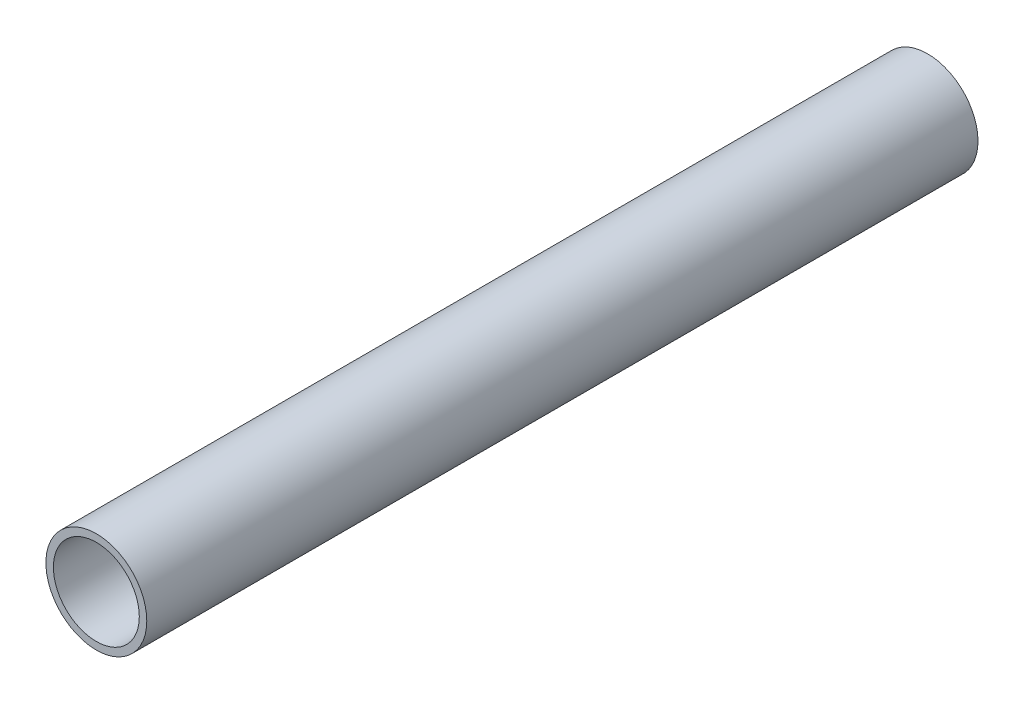
ISO-10303-21;
HEADER;
FILE_DESCRIPTION(('STEP AP214'),'2;1');
FILE_NAME('part.step','',(''),(''),'','','');
FILE_SCHEMA(('AUTOMOTIVE_DESIGN { 1 0 10303 214 1 1 1 1 }'));
ENDSEC;
DATA;
#1=APPLICATION_CONTEXT('core data for automotive mechanical design processes');
#2=APPLICATION_PROTOCOL_DEFINITION('international standard','automotive_design',2000,#1);
#3=PRODUCT_CONTEXT('',#1,'mechanical');
#4=PRODUCT('Part','Part','',(#3));
#5=PRODUCT_RELATED_PRODUCT_CATEGORY('part','',(#4));
#6=PRODUCT_DEFINITION_FORMATION('','',#4);
#7=PRODUCT_DEFINITION_CONTEXT('part definition',#1,'design');
#8=PRODUCT_DEFINITION('design','',#6,#7);
#9=PRODUCT_DEFINITION_SHAPE('','',#8);
#10=(LENGTH_UNIT() NAMED_UNIT(*) SI_UNIT(.MILLI.,.METRE.));
#11=(NAMED_UNIT(*) PLANE_ANGLE_UNIT() SI_UNIT($,.RADIAN.));
#12=(NAMED_UNIT(*) SI_UNIT($,.STERADIAN.) SOLID_ANGLE_UNIT());
#13=UNCERTAINTY_MEASURE_WITH_UNIT(LENGTH_MEASURE(1.E-05),#10,'distance_accuracy_value','');
#14=(GEOMETRIC_REPRESENTATION_CONTEXT(3) GLOBAL_UNCERTAINTY_ASSIGNED_CONTEXT((#13)) GLOBAL_UNIT_ASSIGNED_CONTEXT((#10,
#11,#12)) REPRESENTATION_CONTEXT('',''));
#15=CARTESIAN_POINT('',(0.,0.,0.));
#16=DIRECTION('',(0.,0.,1.));
#17=DIRECTION('',(1.,0.,0.));
#18=AXIS2_PLACEMENT_3D('',#15,#16,#17);
#19=CARTESIAN_POINT('',(0.,0.,44.5));
#20=DIRECTION('',(0.,0.,1.));
#21=DIRECTION('',(1.,0.,0.));
#22=AXIS2_PLACEMENT_3D('',#19,#20,#21);
#23=PLANE('',#22);
#24=CARTESIAN_POINT('',(0.,0.,44.5));
#25=DIRECTION('',(0.,0.,1.));
#26=DIRECTION('',(1.,0.,0.));
#27=AXIS2_PLACEMENT_3D('',#24,#25,#26);
#28=CIRCLE('',#27,2.7);
#29=CARTESIAN_POINT('',(2.7,0.,44.5));
#30=VERTEX_POINT('',#29);
#31=EDGE_CURVE('E10',#30,#30,#28,.T.);
#32=ORIENTED_EDGE('',*,*,#31,.T.);
#33=EDGE_LOOP('',(#32));
#34=FACE_BOUND('',#33,.T.);
#35=CARTESIAN_POINT('',(0.,0.,44.5));
#36=DIRECTION('',(0.,0.,1.));
#37=DIRECTION('',(1.,0.,0.));
#38=AXIS2_PLACEMENT_3D('',#35,#36,#37);
#39=CIRCLE('',#38,2.3);
#40=CARTESIAN_POINT('',(2.3,0.,44.5));
#41=VERTEX_POINT('',#40);
#42=EDGE_CURVE('E50',#41,#41,#39,.T.);
#43=ORIENTED_EDGE('',*,*,#42,.F.);
#44=EDGE_LOOP('',(#43));
#45=FACE_BOUND('',#44,.T.);
#46=ADVANCED_FACE('F37',(#34,#45),#23,.T.);
#47=CARTESIAN_POINT('',(0.,0.,0.));
#48=DIRECTION('',(0.,0.,1.));
#49=DIRECTION('',(1.,0.,0.));
#50=AXIS2_PLACEMENT_3D('',#47,#48,#49);
#51=PLANE('',#50);
#52=CARTESIAN_POINT('',(0.,0.,0.));
#53=DIRECTION('',(0.,0.,1.));
#54=DIRECTION('',(1.,0.,0.));
#55=AXIS2_PLACEMENT_3D('',#52,#53,#54);
#56=CIRCLE('',#55,2.7);
#57=CARTESIAN_POINT('',(2.7,0.,0.));
#58=VERTEX_POINT('',#57);
#59=EDGE_CURVE('E41',#58,#58,#56,.T.);
#60=ORIENTED_EDGE('',*,*,#59,.F.);
#61=EDGE_LOOP('',(#60));
#62=FACE_BOUND('',#61,.T.);
#63=CARTESIAN_POINT('',(0.,0.,0.));
#64=DIRECTION('',(0.,0.,1.));
#65=DIRECTION('',(1.,0.,0.));
#66=AXIS2_PLACEMENT_3D('',#63,#64,#65);
#67=CIRCLE('',#66,2.3);
#68=CARTESIAN_POINT('',(2.3,0.,0.));
#69=VERTEX_POINT('',#68);
#70=EDGE_CURVE('E52',#69,#69,#67,.T.);
#71=ORIENTED_EDGE('',*,*,#70,.T.);
#72=EDGE_LOOP('',(#71));
#73=FACE_BOUND('',#72,.T.);
#74=ADVANCED_FACE('F64',(#62,#73),#51,.F.);
#75=CARTESIAN_POINT('',(0.,0.,44.5));
#76=DIRECTION('',(0.,0.,-1.));
#77=DIRECTION('',(-1.,0.,0.));
#78=AXIS2_PLACEMENT_3D('',#75,#76,#77);
#79=CYLINDRICAL_SURFACE('',#78,2.7);
#80=ORIENTED_EDGE('',*,*,#31,.F.);
#81=EDGE_LOOP('',(#80));
#82=FACE_BOUND('',#81,.T.);
#83=ORIENTED_EDGE('',*,*,#59,.T.);
#84=EDGE_LOOP('',(#83));
#85=FACE_BOUND('',#84,.T.);
#86=ADVANCED_FACE('F39',(#82,#85),#79,.T.);
#87=CARTESIAN_POINT('',(0.,0.,44.5));
#88=DIRECTION('',(0.,0.,-1.));
#89=DIRECTION('',(-1.,0.,0.));
#90=AXIS2_PLACEMENT_3D('',#87,#88,#89);
#91=CYLINDRICAL_SURFACE('',#90,2.3);
#92=ORIENTED_EDGE('',*,*,#42,.T.);
#93=EDGE_LOOP('',(#92));
#94=FACE_BOUND('',#93,.T.);
#95=ORIENTED_EDGE('',*,*,#70,.F.);
#96=EDGE_LOOP('',(#95));
#97=FACE_BOUND('',#96,.T.);
#98=ADVANCED_FACE('F60',(#94,#97),#91,.F.);
#99=CLOSED_SHELL('',(#46,#74,#86,#98));
#100=MANIFOLD_SOLID_BREP('B2',#99);
#101=ADVANCED_BREP_SHAPE_REPRESENTATION('',(#18,#100),#14);
#102=SHAPE_DEFINITION_REPRESENTATION(#9,#101);
ENDSEC;
END-ISO-10303-21;
